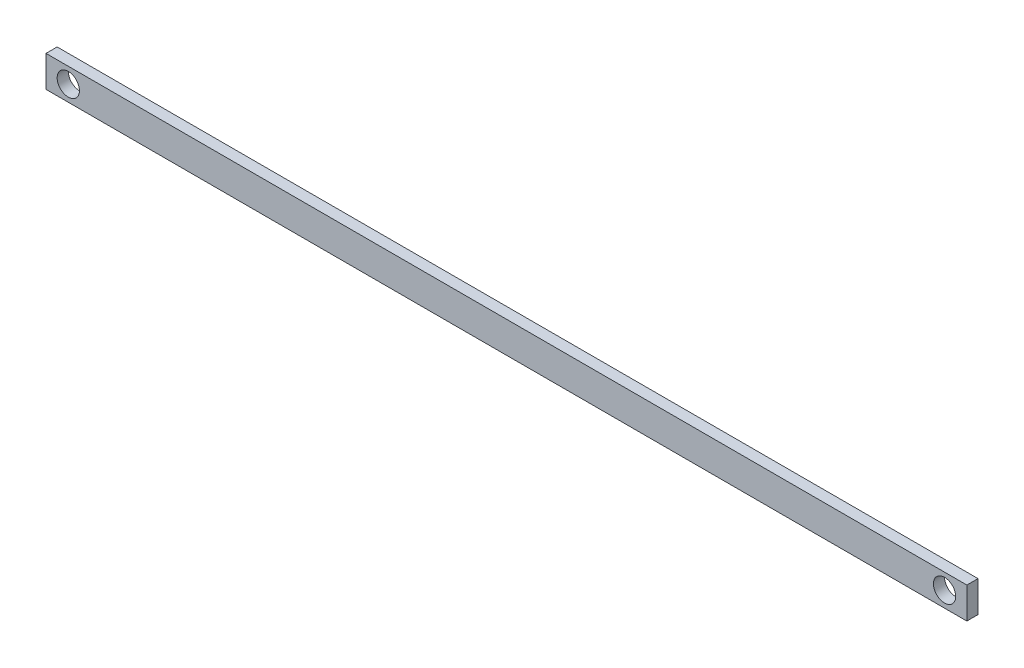
ISO-10303-21;
HEADER;
FILE_DESCRIPTION(('STEP AP214'),'2;1');
FILE_NAME('part.step','',(''),(''),'','','');
FILE_SCHEMA(('AUTOMOTIVE_DESIGN { 1 0 10303 214 1 1 1 1 }'));
ENDSEC;
DATA;
#1=APPLICATION_CONTEXT('core data for automotive mechanical design processes');
#2=APPLICATION_PROTOCOL_DEFINITION('international standard','automotive_design',2000,#1);
#3=PRODUCT_CONTEXT('',#1,'mechanical');
#4=PRODUCT('Part','Part','',(#3));
#5=PRODUCT_RELATED_PRODUCT_CATEGORY('part','',(#4));
#6=PRODUCT_DEFINITION_FORMATION('','',#4);
#7=PRODUCT_DEFINITION_CONTEXT('part definition',#1,'design');
#8=PRODUCT_DEFINITION('design','',#6,#7);
#9=PRODUCT_DEFINITION_SHAPE('','',#8);
#10=(LENGTH_UNIT() NAMED_UNIT(*) SI_UNIT(.MILLI.,.METRE.));
#11=(NAMED_UNIT(*) PLANE_ANGLE_UNIT() SI_UNIT($,.RADIAN.));
#12=(NAMED_UNIT(*) SI_UNIT($,.STERADIAN.) SOLID_ANGLE_UNIT());
#13=UNCERTAINTY_MEASURE_WITH_UNIT(LENGTH_MEASURE(1.E-05),#10,'distance_accuracy_value','');
#14=(GEOMETRIC_REPRESENTATION_CONTEXT(3) GLOBAL_UNCERTAINTY_ASSIGNED_CONTEXT((#13)) GLOBAL_UNIT_ASSIGNED_CONTEXT((#10,
#11,#12)) REPRESENTATION_CONTEXT('',''));
#15=CARTESIAN_POINT('',(0.,0.,0.));
#16=DIRECTION('',(0.,0.,1.));
#17=DIRECTION('',(1.,0.,0.));
#18=AXIS2_PLACEMENT_3D('',#15,#16,#17);
#19=CARTESIAN_POINT('',(3930.,0.,50.));
#20=DIRECTION('',(0.,1.,0.));
#21=DIRECTION('',(-1.,0.,0.));
#22=AXIS2_PLACEMENT_3D('',#19,#20,#21);
#23=PLANE('',#22);
#24=DIRECTION('',(1.,0.,0.));
#25=VECTOR('',#24,1.);
#26=CARTESIAN_POINT('',(3930.,0.,0.));
#27=LINE('',#26,#25);
#28=CARTESIAN_POINT('',(-100.,0.,0.));
#29=VERTEX_POINT('',#28);
#30=CARTESIAN_POINT('',(4030.,0.,0.));
#31=VERTEX_POINT('',#30);
#32=EDGE_CURVE('E89',#29,#31,#27,.T.);
#33=ORIENTED_EDGE('',*,*,#32,.T.);
#34=DIRECTION('',(0.,0.,-1.));
#35=VECTOR('',#34,1.);
#36=CARTESIAN_POINT('',(4030.,0.,50.));
#37=LINE('',#36,#35);
#38=CARTESIAN_POINT('',(4030.,0.,50.));
#39=VERTEX_POINT('',#38);
#40=EDGE_CURVE('E115',#39,#31,#37,.T.);
#41=ORIENTED_EDGE('',*,*,#40,.F.);
#42=DIRECTION('',(1.,0.,0.));
#43=VECTOR('',#42,1.);
#44=CARTESIAN_POINT('',(3930.,0.,50.));
#45=LINE('',#44,#43);
#46=CARTESIAN_POINT('',(-100.,0.,50.));
#47=VERTEX_POINT('',#46);
#48=EDGE_CURVE('E56',#47,#39,#45,.T.);
#49=ORIENTED_EDGE('',*,*,#48,.F.);
#50=DIRECTION('',(0.,0.,-1.));
#51=VECTOR('',#50,1.);
#52=CARTESIAN_POINT('',(-100.,0.,50.));
#53=LINE('',#52,#51);
#54=EDGE_CURVE('E98',#47,#29,#53,.T.);
#55=ORIENTED_EDGE('',*,*,#54,.T.);
#56=EDGE_LOOP('',(#33,#41,#49,#55));
#57=FACE_BOUND('',#56,.T.);
#58=ADVANCED_FACE('F39',(#57),#23,.F.);
#59=CARTESIAN_POINT('',(0.,140.,50.));
#60=DIRECTION('',(0.,-1.,0.));
#61=DIRECTION('',(0.,0.,-1.));
#62=AXIS2_PLACEMENT_3D('',#59,#60,#61);
#63=PLANE('',#62);
#64=DIRECTION('',(-1.,0.,0.));
#65=VECTOR('',#64,1.);
#66=CARTESIAN_POINT('',(0.,140.,0.));
#67=LINE('',#66,#65);
#68=CARTESIAN_POINT('',(4030.,140.,0.));
#69=VERTEX_POINT('',#68);
#70=CARTESIAN_POINT('',(-100.,140.,0.));
#71=VERTEX_POINT('',#70);
#72=EDGE_CURVE('E68',#69,#71,#67,.T.);
#73=ORIENTED_EDGE('',*,*,#72,.T.);
#74=DIRECTION('',(0.,0.,-1.));
#75=VECTOR('',#74,1.);
#76=CARTESIAN_POINT('',(-100.,140.,50.));
#77=LINE('',#76,#75);
#78=CARTESIAN_POINT('',(-100.,140.,50.));
#79=VERTEX_POINT('',#78);
#80=EDGE_CURVE('E83',#79,#71,#77,.T.);
#81=ORIENTED_EDGE('',*,*,#80,.F.);
#82=DIRECTION('',(-1.,0.,0.));
#83=VECTOR('',#82,1.);
#84=CARTESIAN_POINT('',(0.,140.,50.));
#85=LINE('',#84,#83);
#86=CARTESIAN_POINT('',(4030.,140.,50.));
#87=VERTEX_POINT('',#86);
#88=EDGE_CURVE('E48',#87,#79,#85,.T.);
#89=ORIENTED_EDGE('',*,*,#88,.F.);
#90=DIRECTION('',(0.,0.,-1.));
#91=VECTOR('',#90,1.);
#92=CARTESIAN_POINT('',(4030.,140.,50.));
#93=LINE('',#92,#91);
#94=EDGE_CURVE('E86',#87,#69,#93,.T.);
#95=ORIENTED_EDGE('',*,*,#94,.T.);
#96=EDGE_LOOP('',(#73,#81,#89,#95));
#97=FACE_BOUND('',#96,.T.);
#98=ADVANCED_FACE('F82',(#97),#63,.F.);
#99=CARTESIAN_POINT('',(0.,0.,50.));
#100=DIRECTION('',(0.,0.,-1.));
#101=DIRECTION('',(-1.,0.,0.));
#102=AXIS2_PLACEMENT_3D('',#99,#100,#101);
#103=PLANE('',#102);
#104=CARTESIAN_POINT('',(0.,70.,50.));
#105=DIRECTION('',(0.,0.,1.));
#106=DIRECTION('',(1.,0.,0.));
#107=AXIS2_PLACEMENT_3D('',#104,#105,#106);
#108=CIRCLE('',#107,50.);
#109=CARTESIAN_POINT('',(50.,70.,50.));
#110=VERTEX_POINT('',#109);
#111=EDGE_CURVE('E119',#110,#110,#108,.T.);
#112=ORIENTED_EDGE('',*,*,#111,.F.);
#113=EDGE_LOOP('',(#112));
#114=FACE_BOUND('',#113,.T.);
#115=CARTESIAN_POINT('',(3930.,70.,50.));
#116=DIRECTION('',(0.,0.,1.));
#117=DIRECTION('',(1.,0.,0.));
#118=AXIS2_PLACEMENT_3D('',#115,#116,#117);
#119=CIRCLE('',#118,50.);
#120=CARTESIAN_POINT('',(3980.,70.,50.));
#121=VERTEX_POINT('',#120);
#122=EDGE_CURVE('E126',#121,#121,#119,.T.);
#123=ORIENTED_EDGE('',*,*,#122,.F.);
#124=EDGE_LOOP('',(#123));
#125=FACE_BOUND('',#124,.T.);
#126=ORIENTED_EDGE('',*,*,#48,.T.);
#127=DIRECTION('',(0.,-1.,0.));
#128=VECTOR('',#127,1.);
#129=CARTESIAN_POINT('',(4030.,140.,50.));
#130=LINE('',#129,#128);
#131=EDGE_CURVE('E109',#87,#39,#130,.T.);
#132=ORIENTED_EDGE('',*,*,#131,.F.);
#133=ORIENTED_EDGE('',*,*,#88,.T.);
#134=DIRECTION('',(0.,1.,0.));
#135=VECTOR('',#134,1.);
#136=CARTESIAN_POINT('',(-100.,140.,50.));
#137=LINE('',#136,#135);
#138=EDGE_CURVE('E95',#47,#79,#137,.T.);
#139=ORIENTED_EDGE('',*,*,#138,.F.);
#140=EDGE_LOOP('',(#126,#132,#133,#139));
#141=FACE_BOUND('',#140,.T.);
#142=ADVANCED_FACE('F141',(#114,#125,#141),#103,.F.);
#143=CARTESIAN_POINT('',(0.,0.,0.));
#144=DIRECTION('',(0.,0.,-1.));
#145=DIRECTION('',(-1.,0.,0.));
#146=AXIS2_PLACEMENT_3D('',#143,#144,#145);
#147=PLANE('',#146);
#148=CARTESIAN_POINT('',(0.,70.,0.));
#149=DIRECTION('',(0.,0.,-1.));
#150=DIRECTION('',(-1.,0.,0.));
#151=AXIS2_PLACEMENT_3D('',#148,#149,#150);
#152=CIRCLE('',#151,50.);
#153=CARTESIAN_POINT('',(-50.,70.,0.));
#154=VERTEX_POINT('',#153);
#155=EDGE_CURVE('E11',#154,#154,#152,.T.);
#156=ORIENTED_EDGE('',*,*,#155,.F.);
#157=EDGE_LOOP('',(#156));
#158=FACE_BOUND('',#157,.T.);
#159=CARTESIAN_POINT('',(3930.,70.,0.));
#160=DIRECTION('',(0.,0.,1.));
#161=DIRECTION('',(1.,0.,0.));
#162=AXIS2_PLACEMENT_3D('',#159,#160,#161);
#163=CIRCLE('',#162,50.);
#164=CARTESIAN_POINT('',(3980.,70.,0.));
#165=VERTEX_POINT('',#164);
#166=EDGE_CURVE('E122',#165,#165,#163,.T.);
#167=ORIENTED_EDGE('',*,*,#166,.T.);
#168=EDGE_LOOP('',(#167));
#169=FACE_BOUND('',#168,.T.);
#170=DIRECTION('',(0.,-1.,0.));
#171=VECTOR('',#170,1.);
#172=CARTESIAN_POINT('',(4030.,140.,0.));
#173=LINE('',#172,#171);
#174=EDGE_CURVE('E97',#69,#31,#173,.T.);
#175=ORIENTED_EDGE('',*,*,#174,.T.);
#176=ORIENTED_EDGE('',*,*,#32,.F.);
#177=DIRECTION('',(0.,1.,0.));
#178=VECTOR('',#177,1.);
#179=CARTESIAN_POINT('',(-100.,140.,0.));
#180=LINE('',#179,#178);
#181=EDGE_CURVE('E94',#29,#71,#180,.T.);
#182=ORIENTED_EDGE('',*,*,#181,.T.);
#183=ORIENTED_EDGE('',*,*,#72,.F.);
#184=EDGE_LOOP('',(#175,#176,#182,#183));
#185=FACE_BOUND('',#184,.T.);
#186=ADVANCED_FACE('F100',(#158,#169,#185),#147,.T.);
#187=CARTESIAN_POINT('',(0.,70.,0.));
#188=DIRECTION('',(0.,0.,1.));
#189=DIRECTION('',(1.,0.,0.));
#190=AXIS2_PLACEMENT_3D('',#187,#188,#189);
#191=CYLINDRICAL_SURFACE('',#190,50.);
#192=ORIENTED_EDGE('',*,*,#155,.T.);
#193=EDGE_LOOP('',(#192));
#194=FACE_BOUND('',#193,.T.);
#195=ORIENTED_EDGE('',*,*,#111,.T.);
#196=EDGE_LOOP('',(#195));
#197=FACE_BOUND('',#196,.T.);
#198=ADVANCED_FACE('F149',(#194,#197),#191,.F.);
#199=CARTESIAN_POINT('',(3930.,70.,0.));
#200=DIRECTION('',(0.,0.,1.));
#201=DIRECTION('',(1.,0.,0.));
#202=AXIS2_PLACEMENT_3D('',#199,#200,#201);
#203=CYLINDRICAL_SURFACE('',#202,50.);
#204=ORIENTED_EDGE('',*,*,#166,.F.);
#205=EDGE_LOOP('',(#204));
#206=FACE_BOUND('',#205,.T.);
#207=ORIENTED_EDGE('',*,*,#122,.T.);
#208=EDGE_LOOP('',(#207));
#209=FACE_BOUND('',#208,.T.);
#210=ADVANCED_FACE('F173',(#206,#209),#203,.F.);
#211=CARTESIAN_POINT('',(4030.,140.,50.));
#212=DIRECTION('',(1.,0.,0.));
#213=DIRECTION('',(0.,0.,-1.));
#214=AXIS2_PLACEMENT_3D('',#211,#212,#213);
#215=PLANE('',#214);
#216=ORIENTED_EDGE('',*,*,#174,.F.);
#217=ORIENTED_EDGE('',*,*,#94,.F.);
#218=ORIENTED_EDGE('',*,*,#131,.T.);
#219=ORIENTED_EDGE('',*,*,#40,.T.);
#220=EDGE_LOOP('',(#216,#217,#218,#219));
#221=FACE_BOUND('',#220,.T.);
#222=ADVANCED_FACE('F140',(#221),#215,.T.);
#223=CARTESIAN_POINT('',(-100.,140.,50.));
#224=DIRECTION('',(-1.,0.,0.));
#225=DIRECTION('',(0.,-1.,0.));
#226=AXIS2_PLACEMENT_3D('',#223,#224,#225);
#227=PLANE('',#226);
#228=ORIENTED_EDGE('',*,*,#181,.F.);
#229=ORIENTED_EDGE('',*,*,#54,.F.);
#230=ORIENTED_EDGE('',*,*,#138,.T.);
#231=ORIENTED_EDGE('',*,*,#80,.T.);
#232=EDGE_LOOP('',(#228,#229,#230,#231));
#233=FACE_BOUND('',#232,.T.);
#234=ADVANCED_FACE('F92',(#233),#227,.T.);
#235=CLOSED_SHELL('',(#58,#98,#142,#186,#198,#210,#222,#234));
#236=MANIFOLD_SOLID_BREP('B2',#235);
#237=ADVANCED_BREP_SHAPE_REPRESENTATION('',(#18,#236),#14);
#238=SHAPE_DEFINITION_REPRESENTATION(#9,#237);
ENDSEC;
END-ISO-10303-21;
